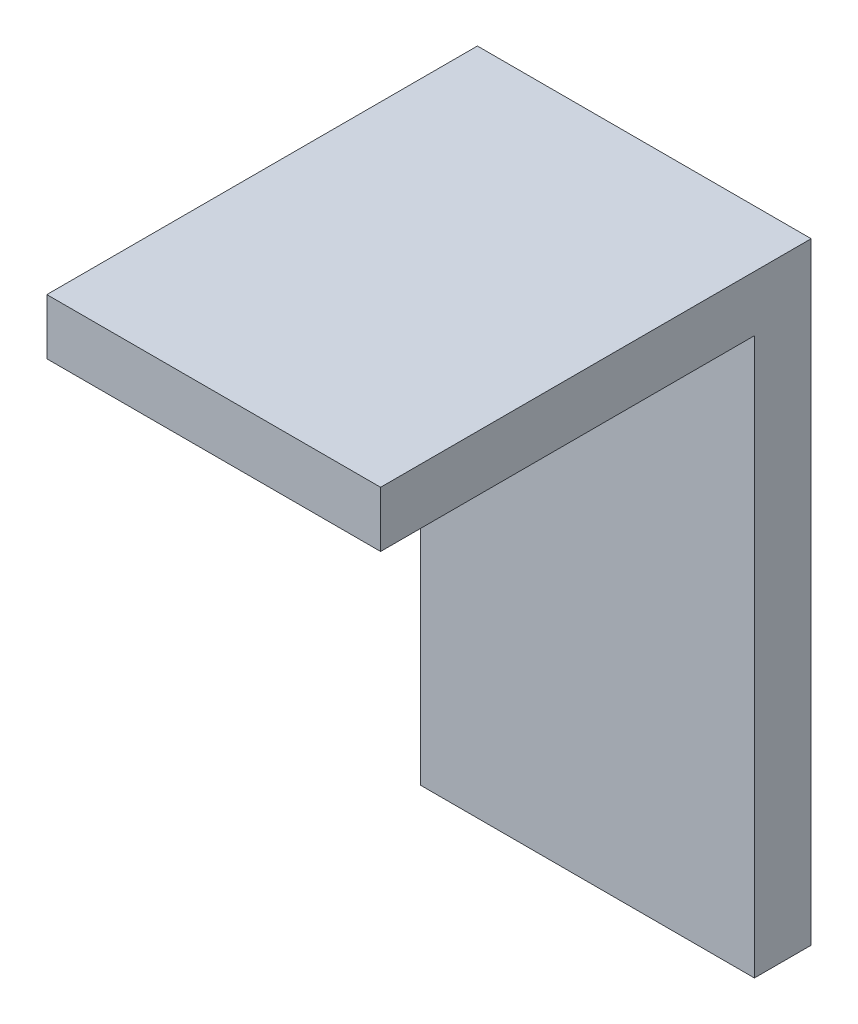
ISO-10303-21;
HEADER;
FILE_DESCRIPTION(('STEP AP214'),'2;1');
FILE_NAME('part.step','',(''),(''),'','','');
FILE_SCHEMA(('AUTOMOTIVE_DESIGN { 1 0 10303 214 1 1 1 1 }'));
ENDSEC;
DATA;
#1=APPLICATION_CONTEXT('core data for automotive mechanical design processes');
#2=APPLICATION_PROTOCOL_DEFINITION('international standard','automotive_design',2000,#1);
#3=PRODUCT_CONTEXT('',#1,'mechanical');
#4=PRODUCT('Part','Part','',(#3));
#5=PRODUCT_RELATED_PRODUCT_CATEGORY('part','',(#4));
#6=PRODUCT_DEFINITION_FORMATION('','',#4);
#7=PRODUCT_DEFINITION_CONTEXT('part definition',#1,'design');
#8=PRODUCT_DEFINITION('design','',#6,#7);
#9=PRODUCT_DEFINITION_SHAPE('','',#8);
#10=(LENGTH_UNIT() NAMED_UNIT(*) SI_UNIT(.MILLI.,.METRE.));
#11=(NAMED_UNIT(*) PLANE_ANGLE_UNIT() SI_UNIT($,.RADIAN.));
#12=(NAMED_UNIT(*) SI_UNIT($,.STERADIAN.) SOLID_ANGLE_UNIT());
#13=UNCERTAINTY_MEASURE_WITH_UNIT(LENGTH_MEASURE(1.E-05),#10,'distance_accuracy_value','');
#14=(GEOMETRIC_REPRESENTATION_CONTEXT(3) GLOBAL_UNCERTAINTY_ASSIGNED_CONTEXT((#13)) GLOBAL_UNIT_ASSIGNED_CONTEXT((#10,
#11,#12)) REPRESENTATION_CONTEXT('',''));
#15=CARTESIAN_POINT('',(0.,0.,0.));
#16=DIRECTION('',(0.,0.,1.));
#17=DIRECTION('',(1.,0.,0.));
#18=AXIS2_PLACEMENT_3D('',#15,#16,#17);
#19=CARTESIAN_POINT('',(2.1,4.55,0.));
#20=DIRECTION('',(-1.,0.,0.));
#21=DIRECTION('',(0.,0.,1.));
#22=AXIS2_PLACEMENT_3D('',#19,#20,#21);
#23=PLANE('',#22);
#24=DIRECTION('',(0.,1.,0.));
#25=VECTOR('',#24,1.);
#26=CARTESIAN_POINT('',(2.1,4.,0.));
#27=LINE('',#26,#25);
#28=CARTESIAN_POINT('',(2.1,4.,0.));
#29=VERTEX_POINT('',#28);
#30=CARTESIAN_POINT('',(2.1,4.55,0.));
#31=VERTEX_POINT('',#30);
#32=EDGE_CURVE('E11',#29,#31,#27,.T.);
#33=ORIENTED_EDGE('',*,*,#32,.F.);
#34=DIRECTION('',(0.,0.,-1.));
#35=VECTOR('',#34,1.);
#36=CARTESIAN_POINT('',(2.1,4.,0.051));
#37=LINE('',#36,#35);
#38=CARTESIAN_POINT('',(2.1,4.,0.051));
#39=VERTEX_POINT('',#38);
#40=EDGE_CURVE('E24',#39,#29,#37,.T.);
#41=ORIENTED_EDGE('',*,*,#40,.F.);
#42=DIRECTION('',(0.,-1.,0.));
#43=VECTOR('',#42,1.);
#44=CARTESIAN_POINT('',(2.1,4.5,0.051));
#45=LINE('',#44,#43);
#46=CARTESIAN_POINT('',(2.1,4.5,0.051));
#47=VERTEX_POINT('',#46);
#48=EDGE_CURVE('E87',#47,#39,#45,.T.);
#49=ORIENTED_EDGE('',*,*,#48,.F.);
#50=DIRECTION('',(0.,0.,-1.));
#51=VECTOR('',#50,1.);
#52=CARTESIAN_POINT('',(2.1,4.5,0.387));
#53=LINE('',#52,#51);
#54=CARTESIAN_POINT('',(2.1,4.5,0.387));
#55=VERTEX_POINT('',#54);
#56=EDGE_CURVE('E114',#55,#47,#53,.T.);
#57=ORIENTED_EDGE('',*,*,#56,.F.);
#58=DIRECTION('',(0.,-1.,0.));
#59=VECTOR('',#58,1.);
#60=CARTESIAN_POINT('',(2.1,4.55,0.387));
#61=LINE('',#60,#59);
#62=CARTESIAN_POINT('',(2.1,4.55,0.387));
#63=VERTEX_POINT('',#62);
#64=EDGE_CURVE('E111',#63,#55,#61,.T.);
#65=ORIENTED_EDGE('',*,*,#64,.F.);
#66=DIRECTION('',(0.,0.,1.));
#67=VECTOR('',#66,1.);
#68=CARTESIAN_POINT('',(2.1,4.55,0.));
#69=LINE('',#68,#67);
#70=EDGE_CURVE('E108',#31,#63,#69,.T.);
#71=ORIENTED_EDGE('',*,*,#70,.F.);
#72=EDGE_LOOP('',(#33,#41,#49,#57,#65,#71));
#73=FACE_BOUND('',#72,.T.);
#74=ADVANCED_FACE('F17',(#73),#23,.T.);
#75=CARTESIAN_POINT('',(2.4,4.,0.));
#76=DIRECTION('',(1.,0.,0.));
#77=DIRECTION('',(0.,0.,1.));
#78=AXIS2_PLACEMENT_3D('',#75,#76,#77);
#79=PLANE('',#78);
#80=DIRECTION('',(0.,-1.,0.));
#81=VECTOR('',#80,1.);
#82=CARTESIAN_POINT('',(2.4,4.55,0.));
#83=LINE('',#82,#81);
#84=CARTESIAN_POINT('',(2.4,4.55,0.));
#85=VERTEX_POINT('',#84);
#86=CARTESIAN_POINT('',(2.4,4.,0.));
#87=VERTEX_POINT('',#86);
#88=EDGE_CURVE('E106',#85,#87,#83,.T.);
#89=ORIENTED_EDGE('',*,*,#88,.F.);
#90=DIRECTION('',(0.,0.,-1.));
#91=VECTOR('',#90,1.);
#92=CARTESIAN_POINT('',(2.4,4.55,0.387));
#93=LINE('',#92,#91);
#94=CARTESIAN_POINT('',(2.4,4.55,0.387));
#95=VERTEX_POINT('',#94);
#96=EDGE_CURVE('E103',#95,#85,#93,.T.);
#97=ORIENTED_EDGE('',*,*,#96,.F.);
#98=DIRECTION('',(0.,1.,0.));
#99=VECTOR('',#98,1.);
#100=CARTESIAN_POINT('',(2.4,4.5,0.387));
#101=LINE('',#100,#99);
#102=CARTESIAN_POINT('',(2.4,4.5,0.387));
#103=VERTEX_POINT('',#102);
#104=EDGE_CURVE('E100',#103,#95,#101,.T.);
#105=ORIENTED_EDGE('',*,*,#104,.F.);
#106=DIRECTION('',(0.,0.,1.));
#107=VECTOR('',#106,1.);
#108=CARTESIAN_POINT('',(2.4,4.5,0.051));
#109=LINE('',#108,#107);
#110=CARTESIAN_POINT('',(2.4,4.5,0.051));
#111=VERTEX_POINT('',#110);
#112=EDGE_CURVE('E72',#111,#103,#109,.T.);
#113=ORIENTED_EDGE('',*,*,#112,.F.);
#114=DIRECTION('',(0.,1.,0.));
#115=VECTOR('',#114,1.);
#116=CARTESIAN_POINT('',(2.4,4.,0.051));
#117=LINE('',#116,#115);
#118=CARTESIAN_POINT('',(2.4,4.,0.051));
#119=VERTEX_POINT('',#118);
#120=EDGE_CURVE('E66',#119,#111,#117,.T.);
#121=ORIENTED_EDGE('',*,*,#120,.F.);
#122=DIRECTION('',(0.,0.,1.));
#123=VECTOR('',#122,1.);
#124=CARTESIAN_POINT('',(2.4,4.,0.));
#125=LINE('',#124,#123);
#126=EDGE_CURVE('E69',#87,#119,#125,.T.);
#127=ORIENTED_EDGE('',*,*,#126,.F.);
#128=EDGE_LOOP('',(#89,#97,#105,#113,#121,#127));
#129=FACE_BOUND('',#128,.T.);
#130=ADVANCED_FACE('F68',(#129),#79,.T.);
#131=CARTESIAN_POINT('',(2.1,4.55,0.387));
#132=DIRECTION('',(0.,0.,1.));
#133=DIRECTION('',(0.,1.,0.));
#134=AXIS2_PLACEMENT_3D('',#131,#132,#133);
#135=PLANE('',#134);
#136=ORIENTED_EDGE('',*,*,#64,.T.);
#137=DIRECTION('',(-1.,0.,0.));
#138=VECTOR('',#137,1.);
#139=CARTESIAN_POINT('',(2.4,4.5,0.387));
#140=LINE('',#139,#138);
#141=EDGE_CURVE('E83',#103,#55,#140,.T.);
#142=ORIENTED_EDGE('',*,*,#141,.F.);
#143=ORIENTED_EDGE('',*,*,#104,.T.);
#144=DIRECTION('',(1.,0.,0.));
#145=VECTOR('',#144,1.);
#146=CARTESIAN_POINT('',(2.1,4.55,0.387));
#147=LINE('',#146,#145);
#148=EDGE_CURVE('E88',#63,#95,#147,.T.);
#149=ORIENTED_EDGE('',*,*,#148,.F.);
#150=EDGE_LOOP('',(#136,#142,#143,#149));
#151=FACE_BOUND('',#150,.T.);
#152=ADVANCED_FACE('F125',(#151),#135,.T.);
#153=CARTESIAN_POINT('',(2.1,4.5,0.051));
#154=DIRECTION('',(0.,0.,1.));
#155=DIRECTION('',(0.,1.,0.));
#156=AXIS2_PLACEMENT_3D('',#153,#154,#155);
#157=PLANE('',#156);
#158=ORIENTED_EDGE('',*,*,#48,.T.);
#159=DIRECTION('',(-1.,0.,0.));
#160=VECTOR('',#159,1.);
#161=CARTESIAN_POINT('',(2.4,4.,0.051));
#162=LINE('',#161,#160);
#163=EDGE_CURVE('E81',#119,#39,#162,.T.);
#164=ORIENTED_EDGE('',*,*,#163,.F.);
#165=ORIENTED_EDGE('',*,*,#120,.T.);
#166=DIRECTION('',(1.,0.,0.));
#167=VECTOR('',#166,1.);
#168=CARTESIAN_POINT('',(2.1,4.5,0.051));
#169=LINE('',#168,#167);
#170=EDGE_CURVE('E89',#47,#111,#169,.T.);
#171=ORIENTED_EDGE('',*,*,#170,.F.);
#172=EDGE_LOOP('',(#158,#164,#165,#171));
#173=FACE_BOUND('',#172,.T.);
#174=ADVANCED_FACE('F86',(#173),#157,.T.);
#175=CARTESIAN_POINT('',(2.4,4.55,0.));
#176=DIRECTION('',(0.,1.,0.));
#177=DIRECTION('',(0.,0.,1.));
#178=AXIS2_PLACEMENT_3D('',#175,#176,#177);
#179=PLANE('',#178);
#180=DIRECTION('',(1.,0.,0.));
#181=VECTOR('',#180,1.);
#182=CARTESIAN_POINT('',(2.1,4.55,0.));
#183=LINE('',#182,#181);
#184=EDGE_CURVE('E93',#31,#85,#183,.T.);
#185=ORIENTED_EDGE('',*,*,#184,.F.);
#186=ORIENTED_EDGE('',*,*,#70,.T.);
#187=ORIENTED_EDGE('',*,*,#148,.T.);
#188=ORIENTED_EDGE('',*,*,#96,.T.);
#189=EDGE_LOOP('',(#185,#186,#187,#188));
#190=FACE_BOUND('',#189,.T.);
#191=ADVANCED_FACE('F121',(#190),#179,.T.);
#192=CARTESIAN_POINT('',(2.1,4.,0.));
#193=DIRECTION('',(0.,-1.,0.));
#194=DIRECTION('',(0.,0.,1.));
#195=AXIS2_PLACEMENT_3D('',#192,#193,#194);
#196=PLANE('',#195);
#197=DIRECTION('',(-1.,0.,0.));
#198=VECTOR('',#197,1.);
#199=CARTESIAN_POINT('',(2.4,4.,0.));
#200=LINE('',#199,#198);
#201=EDGE_CURVE('E82',#87,#29,#200,.T.);
#202=ORIENTED_EDGE('',*,*,#201,.F.);
#203=ORIENTED_EDGE('',*,*,#126,.T.);
#204=ORIENTED_EDGE('',*,*,#163,.T.);
#205=ORIENTED_EDGE('',*,*,#40,.T.);
#206=EDGE_LOOP('',(#202,#203,#204,#205));
#207=FACE_BOUND('',#206,.T.);
#208=ADVANCED_FACE('F80',(#207),#196,.T.);
#209=CARTESIAN_POINT('',(2.1,4.5,0.051));
#210=DIRECTION('',(0.,-1.,0.));
#211=DIRECTION('',(0.,0.,1.));
#212=AXIS2_PLACEMENT_3D('',#209,#210,#211);
#213=PLANE('',#212);
#214=ORIENTED_EDGE('',*,*,#170,.T.);
#215=ORIENTED_EDGE('',*,*,#112,.T.);
#216=ORIENTED_EDGE('',*,*,#141,.T.);
#217=ORIENTED_EDGE('',*,*,#56,.T.);
#218=EDGE_LOOP('',(#214,#215,#216,#217));
#219=FACE_BOUND('',#218,.T.);
#220=ADVANCED_FACE('F127',(#219),#213,.T.);
#221=CARTESIAN_POINT('',(2.4,4.55,0.));
#222=DIRECTION('',(0.,0.,-1.));
#223=DIRECTION('',(0.,1.,0.));
#224=AXIS2_PLACEMENT_3D('',#221,#222,#223);
#225=PLANE('',#224);
#226=ORIENTED_EDGE('',*,*,#88,.T.);
#227=ORIENTED_EDGE('',*,*,#201,.T.);
#228=ORIENTED_EDGE('',*,*,#32,.T.);
#229=ORIENTED_EDGE('',*,*,#184,.T.);
#230=EDGE_LOOP('',(#226,#227,#228,#229));
#231=FACE_BOUND('',#230,.T.);
#232=ADVANCED_FACE('F117',(#231),#225,.T.);
#233=CLOSED_SHELL('',(#74,#130,#152,#174,#191,#208,#220,#232));
#234=MANIFOLD_SOLID_BREP('B1',#233);
#235=ADVANCED_BREP_SHAPE_REPRESENTATION('',(#18,#234),#14);
#236=SHAPE_DEFINITION_REPRESENTATION(#9,#235);
ENDSEC;
END-ISO-10303-21;
